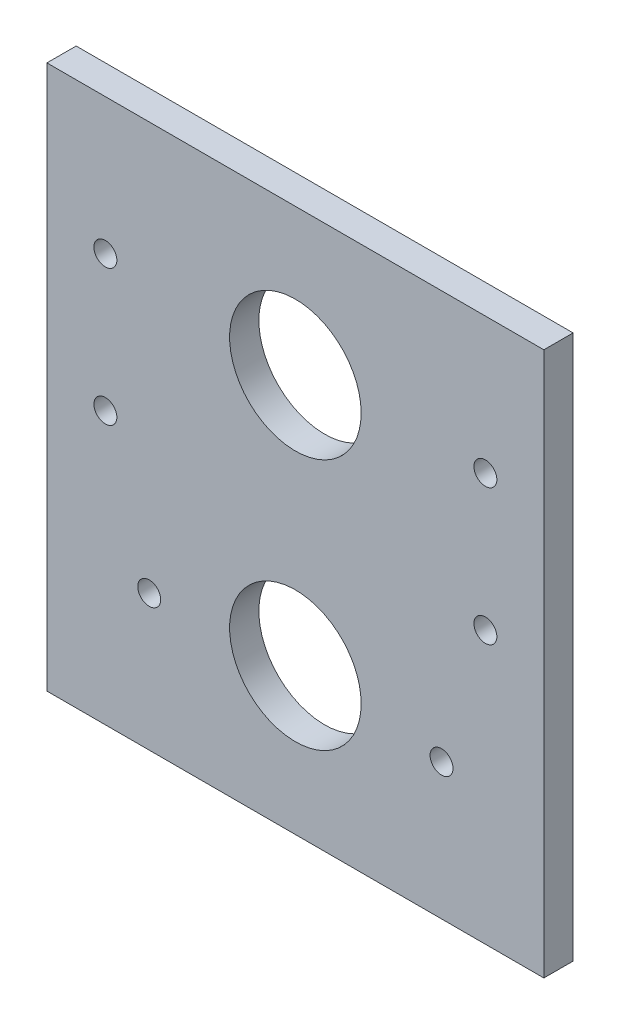
ISO-10303-21;
HEADER;
FILE_DESCRIPTION(('STEP AP214'),'2;1');
FILE_NAME('part.step','',(''),(''),'','','');
FILE_SCHEMA(('AUTOMOTIVE_DESIGN { 1 0 10303 214 1 1 1 1 }'));
ENDSEC;
DATA;
#1=APPLICATION_CONTEXT('core data for automotive mechanical design processes');
#2=APPLICATION_PROTOCOL_DEFINITION('international standard','automotive_design',2000,#1);
#3=PRODUCT_CONTEXT('',#1,'mechanical');
#4=PRODUCT('Part','Part','',(#3));
#5=PRODUCT_RELATED_PRODUCT_CATEGORY('part','',(#4));
#6=PRODUCT_DEFINITION_FORMATION('','',#4);
#7=PRODUCT_DEFINITION_CONTEXT('part definition',#1,'design');
#8=PRODUCT_DEFINITION('design','',#6,#7);
#9=PRODUCT_DEFINITION_SHAPE('','',#8);
#10=(LENGTH_UNIT() NAMED_UNIT(*) SI_UNIT(.MILLI.,.METRE.));
#11=(NAMED_UNIT(*) PLANE_ANGLE_UNIT() SI_UNIT($,.RADIAN.));
#12=(NAMED_UNIT(*) SI_UNIT($,.STERADIAN.) SOLID_ANGLE_UNIT());
#13=UNCERTAINTY_MEASURE_WITH_UNIT(LENGTH_MEASURE(1.E-05),#10,'distance_accuracy_value','');
#14=(GEOMETRIC_REPRESENTATION_CONTEXT(3) GLOBAL_UNCERTAINTY_ASSIGNED_CONTEXT((#13)) GLOBAL_UNIT_ASSIGNED_CONTEXT((#10,
#11,#12)) REPRESENTATION_CONTEXT('',''));
#15=CARTESIAN_POINT('',(0.,0.,0.));
#16=DIRECTION('',(0.,0.,1.));
#17=DIRECTION('',(1.,0.,0.));
#18=AXIS2_PLACEMENT_3D('',#15,#16,#17);
#19=CARTESIAN_POINT('',(0.,0.,6.35));
#20=DIRECTION('',(0.,0.,-1.));
#21=DIRECTION('',(-1.,0.,0.));
#22=AXIS2_PLACEMENT_3D('',#19,#20,#21);
#23=PLANE('',#22);
#24=DIRECTION('',(0.,-1.,0.));
#25=VECTOR('',#24,1.);
#26=CARTESIAN_POINT('',(0.,0.,6.35));
#27=LINE('',#26,#25);
#28=CARTESIAN_POINT('',(0.,118.1862,6.35));
#29=VERTEX_POINT('',#28);
#30=CARTESIAN_POINT('',(0.,0.,6.35));
#31=VERTEX_POINT('',#30);
#32=EDGE_CURVE('E87',#29,#31,#27,.T.);
#33=ORIENTED_EDGE('',*,*,#32,.T.);
#34=DIRECTION('',(1.,0.,0.));
#35=VECTOR('',#34,1.);
#36=CARTESIAN_POINT('',(0.,0.,6.35));
#37=LINE('',#36,#35);
#38=CARTESIAN_POINT('',(107.95,0.,6.35));
#39=VERTEX_POINT('',#38);
#40=EDGE_CURVE('E82',#31,#39,#37,.T.);
#41=ORIENTED_EDGE('',*,*,#40,.T.);
#42=DIRECTION('',(0.,1.,0.));
#43=VECTOR('',#42,1.);
#44=CARTESIAN_POINT('',(107.95,0.,6.35));
#45=LINE('',#44,#43);
#46=CARTESIAN_POINT('',(107.95,118.1862,6.35));
#47=VERTEX_POINT('',#46);
#48=EDGE_CURVE('E85',#39,#47,#45,.T.);
#49=ORIENTED_EDGE('',*,*,#48,.T.);
#50=DIRECTION('',(-1.,0.,0.));
#51=VECTOR('',#50,1.);
#52=CARTESIAN_POINT('',(0.,118.1862,6.35));
#53=LINE('',#52,#51);
#54=EDGE_CURVE('E52',#47,#29,#53,.T.);
#55=ORIENTED_EDGE('',*,*,#54,.T.);
#56=EDGE_LOOP('',(#33,#41,#49,#55));
#57=FACE_BOUND('',#56,.T.);
#58=CARTESIAN_POINT('',(53.975,86.4362,6.35));
#59=DIRECTION('',(0.,0.,1.));
#60=DIRECTION('',(1.,0.,0.));
#61=AXIS2_PLACEMENT_3D('',#58,#59,#60);
#62=CIRCLE('',#61,14.2875);
#63=CARTESIAN_POINT('',(68.2625,86.4362,6.35));
#64=VERTEX_POINT('',#63);
#65=EDGE_CURVE('E102',#64,#64,#62,.T.);
#66=ORIENTED_EDGE('',*,*,#65,.F.);
#67=EDGE_LOOP('',(#66));
#68=FACE_BOUND('',#67,.T.);
#69=CARTESIAN_POINT('',(53.975,31.75,6.35));
#70=DIRECTION('',(0.,0.,1.));
#71=DIRECTION('',(1.,0.,0.));
#72=AXIS2_PLACEMENT_3D('',#69,#70,#71);
#73=CIRCLE('',#72,14.2875);
#74=CARTESIAN_POINT('',(68.2625,31.75,6.35));
#75=VERTEX_POINT('',#74);
#76=EDGE_CURVE('E117',#75,#75,#73,.T.);
#77=ORIENTED_EDGE('',*,*,#76,.F.);
#78=EDGE_LOOP('',(#77));
#79=FACE_BOUND('',#78,.T.);
#80=CARTESIAN_POINT('',(95.25,59.0931,6.35));
#81=DIRECTION('',(0.,0.,1.));
#82=DIRECTION('',(1.,0.,0.));
#83=AXIS2_PLACEMENT_3D('',#80,#81,#82);
#84=CIRCLE('',#83,2.4892);
#85=CARTESIAN_POINT('',(97.7392,59.0931,6.35));
#86=VERTEX_POINT('',#85);
#87=EDGE_CURVE('E123',#86,#86,#84,.T.);
#88=ORIENTED_EDGE('',*,*,#87,.F.);
#89=EDGE_LOOP('',(#88));
#90=FACE_BOUND('',#89,.T.);
#91=CARTESIAN_POINT('',(95.25,88.63965,6.35));
#92=DIRECTION('',(0.,0.,1.));
#93=DIRECTION('',(1.,0.,0.));
#94=AXIS2_PLACEMENT_3D('',#91,#92,#93);
#95=CIRCLE('',#94,2.4892);
#96=CARTESIAN_POINT('',(97.7392,88.63965,6.35));
#97=VERTEX_POINT('',#96);
#98=EDGE_CURVE('E129',#97,#97,#95,.T.);
#99=ORIENTED_EDGE('',*,*,#98,.F.);
#100=EDGE_LOOP('',(#99));
#101=FACE_BOUND('',#100,.T.);
#102=CARTESIAN_POINT('',(12.7,88.63965,6.35));
#103=DIRECTION('',(0.,0.,1.));
#104=DIRECTION('',(1.,0.,0.));
#105=AXIS2_PLACEMENT_3D('',#102,#103,#104);
#106=CIRCLE('',#105,2.48919999999999);
#107=CARTESIAN_POINT('',(15.1892,88.63965,6.35));
#108=VERTEX_POINT('',#107);
#109=EDGE_CURVE('E135',#108,#108,#106,.T.);
#110=ORIENTED_EDGE('',*,*,#109,.F.);
#111=EDGE_LOOP('',(#110));
#112=FACE_BOUND('',#111,.T.);
#113=CARTESIAN_POINT('',(12.7,59.0931,6.35));
#114=DIRECTION('',(0.,0.,1.));
#115=DIRECTION('',(1.,0.,0.));
#116=AXIS2_PLACEMENT_3D('',#113,#114,#115);
#117=CIRCLE('',#116,2.4892);
#118=CARTESIAN_POINT('',(15.1892,59.0931,6.35));
#119=VERTEX_POINT('',#118);
#120=EDGE_CURVE('E141',#119,#119,#117,.T.);
#121=ORIENTED_EDGE('',*,*,#120,.F.);
#122=EDGE_LOOP('',(#121));
#123=FACE_BOUND('',#122,.T.);
#124=CARTESIAN_POINT('',(22.225,29.54655,6.35));
#125=DIRECTION('',(0.,0.,1.));
#126=DIRECTION('',(1.,0.,0.));
#127=AXIS2_PLACEMENT_3D('',#124,#125,#126);
#128=CIRCLE('',#127,2.4892);
#129=CARTESIAN_POINT('',(24.7142,29.54655,6.35));
#130=VERTEX_POINT('',#129);
#131=EDGE_CURVE('E147',#130,#130,#128,.T.);
#132=ORIENTED_EDGE('',*,*,#131,.F.);
#133=EDGE_LOOP('',(#132));
#134=FACE_BOUND('',#133,.T.);
#135=CARTESIAN_POINT('',(85.725,29.54655,6.35));
#136=DIRECTION('',(0.,0.,1.));
#137=DIRECTION('',(1.,0.,0.));
#138=AXIS2_PLACEMENT_3D('',#135,#136,#137);
#139=CIRCLE('',#138,2.4892);
#140=CARTESIAN_POINT('',(88.2142,29.54655,6.35));
#141=VERTEX_POINT('',#140);
#142=EDGE_CURVE('E153',#141,#141,#139,.T.);
#143=ORIENTED_EDGE('',*,*,#142,.F.);
#144=EDGE_LOOP('',(#143));
#145=FACE_BOUND('',#144,.T.);
#146=ADVANCED_FACE('F35',(#57,#68,#79,#90,#101,#112,#123,#134,#145),#23,.F.);
#147=CARTESIAN_POINT('',(0.,0.,0.));
#148=DIRECTION('',(0.,0.,-1.));
#149=DIRECTION('',(-1.,0.,0.));
#150=AXIS2_PLACEMENT_3D('',#147,#148,#149);
#151=PLANE('',#150);
#152=CARTESIAN_POINT('',(22.225,29.54655,0.));
#153=DIRECTION('',(0.,0.,1.));
#154=DIRECTION('',(1.,0.,0.));
#155=AXIS2_PLACEMENT_3D('',#152,#153,#154);
#156=CIRCLE('',#155,2.4892);
#157=CARTESIAN_POINT('',(24.7142,29.54655,0.));
#158=VERTEX_POINT('',#157);
#159=EDGE_CURVE('E150',#158,#158,#156,.T.);
#160=ORIENTED_EDGE('',*,*,#159,.T.);
#161=EDGE_LOOP('',(#160));
#162=FACE_BOUND('',#161,.T.);
#163=CARTESIAN_POINT('',(12.7,88.63965,0.));
#164=DIRECTION('',(0.,0.,1.));
#165=DIRECTION('',(1.,0.,0.));
#166=AXIS2_PLACEMENT_3D('',#163,#164,#165);
#167=CIRCLE('',#166,2.48919999999999);
#168=CARTESIAN_POINT('',(15.1892,88.63965,0.));
#169=VERTEX_POINT('',#168);
#170=EDGE_CURVE('E138',#169,#169,#167,.T.);
#171=ORIENTED_EDGE('',*,*,#170,.T.);
#172=EDGE_LOOP('',(#171));
#173=FACE_BOUND('',#172,.T.);
#174=CARTESIAN_POINT('',(95.25,59.0931,0.));
#175=DIRECTION('',(0.,0.,1.));
#176=DIRECTION('',(1.,0.,0.));
#177=AXIS2_PLACEMENT_3D('',#174,#175,#176);
#178=CIRCLE('',#177,2.4892);
#179=CARTESIAN_POINT('',(97.7392,59.0931,0.));
#180=VERTEX_POINT('',#179);
#181=EDGE_CURVE('E126',#180,#180,#178,.T.);
#182=ORIENTED_EDGE('',*,*,#181,.T.);
#183=EDGE_LOOP('',(#182));
#184=FACE_BOUND('',#183,.T.);
#185=CARTESIAN_POINT('',(53.975,86.4362,0.));
#186=DIRECTION('',(0.,0.,1.));
#187=DIRECTION('',(1.,0.,0.));
#188=AXIS2_PLACEMENT_3D('',#185,#186,#187);
#189=CIRCLE('',#188,14.2875);
#190=CARTESIAN_POINT('',(68.2625,86.4362,0.));
#191=VERTEX_POINT('',#190);
#192=EDGE_CURVE('E114',#191,#191,#189,.T.);
#193=ORIENTED_EDGE('',*,*,#192,.T.);
#194=EDGE_LOOP('',(#193));
#195=FACE_BOUND('',#194,.T.);
#196=DIRECTION('',(0.,-1.,0.));
#197=VECTOR('',#196,1.);
#198=CARTESIAN_POINT('',(0.,0.,0.));
#199=LINE('',#198,#197);
#200=CARTESIAN_POINT('',(0.,118.1862,0.));
#201=VERTEX_POINT('',#200);
#202=CARTESIAN_POINT('',(0.,0.,0.));
#203=VERTEX_POINT('',#202);
#204=EDGE_CURVE('E99',#201,#203,#199,.T.);
#205=ORIENTED_EDGE('',*,*,#204,.F.);
#206=DIRECTION('',(-1.,0.,0.));
#207=VECTOR('',#206,1.);
#208=CARTESIAN_POINT('',(0.,118.1862,0.));
#209=LINE('',#208,#207);
#210=CARTESIAN_POINT('',(107.95,118.1862,0.));
#211=VERTEX_POINT('',#210);
#212=EDGE_CURVE('E75',#211,#201,#209,.T.);
#213=ORIENTED_EDGE('',*,*,#212,.F.);
#214=DIRECTION('',(0.,1.,0.));
#215=VECTOR('',#214,1.);
#216=CARTESIAN_POINT('',(107.95,0.,0.));
#217=LINE('',#216,#215);
#218=CARTESIAN_POINT('',(107.95,0.,0.));
#219=VERTEX_POINT('',#218);
#220=EDGE_CURVE('E69',#219,#211,#217,.T.);
#221=ORIENTED_EDGE('',*,*,#220,.F.);
#222=DIRECTION('',(1.,0.,0.));
#223=VECTOR('',#222,1.);
#224=CARTESIAN_POINT('',(0.,0.,0.));
#225=LINE('',#224,#223);
#226=EDGE_CURVE('E91',#203,#219,#225,.T.);
#227=ORIENTED_EDGE('',*,*,#226,.F.);
#228=EDGE_LOOP('',(#205,#213,#221,#227));
#229=FACE_BOUND('',#228,.T.);
#230=CARTESIAN_POINT('',(53.975,31.75,0.));
#231=DIRECTION('',(0.,0.,1.));
#232=DIRECTION('',(1.,0.,0.));
#233=AXIS2_PLACEMENT_3D('',#230,#231,#232);
#234=CIRCLE('',#233,14.2875);
#235=CARTESIAN_POINT('',(68.2625,31.75,0.));
#236=VERTEX_POINT('',#235);
#237=EDGE_CURVE('E120',#236,#236,#234,.T.);
#238=ORIENTED_EDGE('',*,*,#237,.T.);
#239=EDGE_LOOP('',(#238));
#240=FACE_BOUND('',#239,.T.);
#241=CARTESIAN_POINT('',(95.25,88.63965,0.));
#242=DIRECTION('',(0.,0.,1.));
#243=DIRECTION('',(1.,0.,0.));
#244=AXIS2_PLACEMENT_3D('',#241,#242,#243);
#245=CIRCLE('',#244,2.4892);
#246=CARTESIAN_POINT('',(97.7392,88.63965,0.));
#247=VERTEX_POINT('',#246);
#248=EDGE_CURVE('E132',#247,#247,#245,.T.);
#249=ORIENTED_EDGE('',*,*,#248,.T.);
#250=EDGE_LOOP('',(#249));
#251=FACE_BOUND('',#250,.T.);
#252=CARTESIAN_POINT('',(12.7,59.0931,0.));
#253=DIRECTION('',(0.,0.,1.));
#254=DIRECTION('',(1.,0.,0.));
#255=AXIS2_PLACEMENT_3D('',#252,#253,#254);
#256=CIRCLE('',#255,2.4892);
#257=CARTESIAN_POINT('',(15.1892,59.0931,0.));
#258=VERTEX_POINT('',#257);
#259=EDGE_CURVE('E144',#258,#258,#256,.T.);
#260=ORIENTED_EDGE('',*,*,#259,.T.);
#261=EDGE_LOOP('',(#260));
#262=FACE_BOUND('',#261,.T.);
#263=CARTESIAN_POINT('',(85.725,29.54655,0.));
#264=DIRECTION('',(0.,0.,1.));
#265=DIRECTION('',(1.,0.,0.));
#266=AXIS2_PLACEMENT_3D('',#263,#264,#265);
#267=CIRCLE('',#266,2.4892);
#268=CARTESIAN_POINT('',(88.2142,29.54655,0.));
#269=VERTEX_POINT('',#268);
#270=EDGE_CURVE('E156',#269,#269,#267,.T.);
#271=ORIENTED_EDGE('',*,*,#270,.T.);
#272=EDGE_LOOP('',(#271));
#273=FACE_BOUND('',#272,.T.);
#274=ADVANCED_FACE('F110',(#162,#173,#184,#195,#229,#240,#251,#262,#273),#151,.T.);
#275=CARTESIAN_POINT('',(0.,0.,6.35));
#276=DIRECTION('',(1.,0.,0.));
#277=DIRECTION('',(0.,0.,-1.));
#278=AXIS2_PLACEMENT_3D('',#275,#276,#277);
#279=PLANE('',#278);
#280=ORIENTED_EDGE('',*,*,#204,.T.);
#281=DIRECTION('',(0.,0.,-1.));
#282=VECTOR('',#281,1.);
#283=CARTESIAN_POINT('',(0.,0.,6.35));
#284=LINE('',#283,#282);
#285=EDGE_CURVE('E11',#31,#203,#284,.T.);
#286=ORIENTED_EDGE('',*,*,#285,.F.);
#287=ORIENTED_EDGE('',*,*,#32,.F.);
#288=DIRECTION('',(0.,0.,-1.));
#289=VECTOR('',#288,1.);
#290=CARTESIAN_POINT('',(0.,118.1862,6.35));
#291=LINE('',#290,#289);
#292=EDGE_CURVE('E95',#29,#201,#291,.T.);
#293=ORIENTED_EDGE('',*,*,#292,.T.);
#294=EDGE_LOOP('',(#280,#286,#287,#293));
#295=FACE_BOUND('',#294,.T.);
#296=ADVANCED_FACE('F37',(#295),#279,.F.);
#297=CARTESIAN_POINT('',(0.,0.,6.35));
#298=DIRECTION('',(0.,1.,0.));
#299=DIRECTION('',(-1.,0.,0.));
#300=AXIS2_PLACEMENT_3D('',#297,#298,#299);
#301=PLANE('',#300);
#302=ORIENTED_EDGE('',*,*,#226,.T.);
#303=DIRECTION('',(0.,0.,-1.));
#304=VECTOR('',#303,1.);
#305=CARTESIAN_POINT('',(107.95,0.,6.35));
#306=LINE('',#305,#304);
#307=EDGE_CURVE('E44',#39,#219,#306,.T.);
#308=ORIENTED_EDGE('',*,*,#307,.F.);
#309=ORIENTED_EDGE('',*,*,#40,.F.);
#310=ORIENTED_EDGE('',*,*,#285,.T.);
#311=EDGE_LOOP('',(#302,#308,#309,#310));
#312=FACE_BOUND('',#311,.T.);
#313=ADVANCED_FACE('F90',(#312),#301,.F.);
#314=CARTESIAN_POINT('',(107.95,0.,6.35));
#315=DIRECTION('',(-1.,0.,0.));
#316=DIRECTION('',(0.,0.,1.));
#317=AXIS2_PLACEMENT_3D('',#314,#315,#316);
#318=PLANE('',#317);
#319=ORIENTED_EDGE('',*,*,#220,.T.);
#320=DIRECTION('',(0.,0.,-1.));
#321=VECTOR('',#320,1.);
#322=CARTESIAN_POINT('',(107.95,118.1862,6.35));
#323=LINE('',#322,#321);
#324=EDGE_CURVE('E92',#47,#211,#323,.T.);
#325=ORIENTED_EDGE('',*,*,#324,.F.);
#326=ORIENTED_EDGE('',*,*,#48,.F.);
#327=ORIENTED_EDGE('',*,*,#307,.T.);
#328=EDGE_LOOP('',(#319,#325,#326,#327));
#329=FACE_BOUND('',#328,.T.);
#330=ADVANCED_FACE('F93',(#329),#318,.F.);
#331=CARTESIAN_POINT('',(0.,118.1862,6.35));
#332=DIRECTION('',(0.,-1.,0.));
#333=DIRECTION('',(1.,0.,0.));
#334=AXIS2_PLACEMENT_3D('',#331,#332,#333);
#335=PLANE('',#334);
#336=ORIENTED_EDGE('',*,*,#212,.T.);
#337=ORIENTED_EDGE('',*,*,#292,.F.);
#338=ORIENTED_EDGE('',*,*,#54,.F.);
#339=ORIENTED_EDGE('',*,*,#324,.T.);
#340=EDGE_LOOP('',(#336,#337,#338,#339));
#341=FACE_BOUND('',#340,.T.);
#342=ADVANCED_FACE('F107',(#341),#335,.F.);
#343=CARTESIAN_POINT('',(53.975,86.4362,6.35));
#344=DIRECTION('',(0.,0.,-1.));
#345=DIRECTION('',(-1.,0.,0.));
#346=AXIS2_PLACEMENT_3D('',#343,#344,#345);
#347=CYLINDRICAL_SURFACE('',#346,14.2875);
#348=ORIENTED_EDGE('',*,*,#65,.T.);
#349=EDGE_LOOP('',(#348));
#350=FACE_BOUND('',#349,.T.);
#351=ORIENTED_EDGE('',*,*,#192,.F.);
#352=EDGE_LOOP('',(#351));
#353=FACE_BOUND('',#352,.T.);
#354=ADVANCED_FACE('F173',(#350,#353),#347,.F.);
#355=CARTESIAN_POINT('',(53.975,31.75,6.35));
#356=DIRECTION('',(0.,0.,-1.));
#357=DIRECTION('',(-1.,0.,0.));
#358=AXIS2_PLACEMENT_3D('',#355,#356,#357);
#359=CYLINDRICAL_SURFACE('',#358,14.2875);
#360=ORIENTED_EDGE('',*,*,#76,.T.);
#361=EDGE_LOOP('',(#360));
#362=FACE_BOUND('',#361,.T.);
#363=ORIENTED_EDGE('',*,*,#237,.F.);
#364=EDGE_LOOP('',(#363));
#365=FACE_BOUND('',#364,.T.);
#366=ADVANCED_FACE('F219',(#362,#365),#359,.F.);
#367=CARTESIAN_POINT('',(95.25,59.0931,6.35));
#368=DIRECTION('',(0.,0.,-1.));
#369=DIRECTION('',(-1.,0.,0.));
#370=AXIS2_PLACEMENT_3D('',#367,#368,#369);
#371=CYLINDRICAL_SURFACE('',#370,2.4892);
#372=ORIENTED_EDGE('',*,*,#87,.T.);
#373=EDGE_LOOP('',(#372));
#374=FACE_BOUND('',#373,.T.);
#375=ORIENTED_EDGE('',*,*,#181,.F.);
#376=EDGE_LOOP('',(#375));
#377=FACE_BOUND('',#376,.T.);
#378=ADVANCED_FACE('F227',(#374,#377),#371,.F.);
#379=CARTESIAN_POINT('',(95.25,88.63965,6.35));
#380=DIRECTION('',(0.,0.,-1.));
#381=DIRECTION('',(-1.,0.,0.));
#382=AXIS2_PLACEMENT_3D('',#379,#380,#381);
#383=CYLINDRICAL_SURFACE('',#382,2.4892);
#384=ORIENTED_EDGE('',*,*,#98,.T.);
#385=EDGE_LOOP('',(#384));
#386=FACE_BOUND('',#385,.T.);
#387=ORIENTED_EDGE('',*,*,#248,.F.);
#388=EDGE_LOOP('',(#387));
#389=FACE_BOUND('',#388,.T.);
#390=ADVANCED_FACE('F235',(#386,#389),#383,.F.);
#391=CARTESIAN_POINT('',(12.7,88.63965,6.35));
#392=DIRECTION('',(0.,0.,-1.));
#393=DIRECTION('',(-1.,0.,0.));
#394=AXIS2_PLACEMENT_3D('',#391,#392,#393);
#395=CYLINDRICAL_SURFACE('',#394,2.48919999999999);
#396=ORIENTED_EDGE('',*,*,#109,.T.);
#397=EDGE_LOOP('',(#396));
#398=FACE_BOUND('',#397,.T.);
#399=ORIENTED_EDGE('',*,*,#170,.F.);
#400=EDGE_LOOP('',(#399));
#401=FACE_BOUND('',#400,.T.);
#402=ADVANCED_FACE('F244',(#398,#401),#395,.F.);
#403=CARTESIAN_POINT('',(12.7,59.0931,6.35));
#404=DIRECTION('',(0.,0.,-1.));
#405=DIRECTION('',(-1.,0.,0.));
#406=AXIS2_PLACEMENT_3D('',#403,#404,#405);
#407=CYLINDRICAL_SURFACE('',#406,2.4892);
#408=ORIENTED_EDGE('',*,*,#120,.T.);
#409=EDGE_LOOP('',(#408));
#410=FACE_BOUND('',#409,.T.);
#411=ORIENTED_EDGE('',*,*,#259,.F.);
#412=EDGE_LOOP('',(#411));
#413=FACE_BOUND('',#412,.T.);
#414=ADVANCED_FACE('F253',(#410,#413),#407,.F.);
#415=CARTESIAN_POINT('',(22.225,29.54655,6.35));
#416=DIRECTION('',(0.,0.,-1.));
#417=DIRECTION('',(-1.,0.,0.));
#418=AXIS2_PLACEMENT_3D('',#415,#416,#417);
#419=CYLINDRICAL_SURFACE('',#418,2.4892);
#420=ORIENTED_EDGE('',*,*,#131,.T.);
#421=EDGE_LOOP('',(#420));
#422=FACE_BOUND('',#421,.T.);
#423=ORIENTED_EDGE('',*,*,#159,.F.);
#424=EDGE_LOOP('',(#423));
#425=FACE_BOUND('',#424,.T.);
#426=ADVANCED_FACE('F262',(#422,#425),#419,.F.);
#427=CARTESIAN_POINT('',(85.725,29.54655,6.35));
#428=DIRECTION('',(0.,0.,-1.));
#429=DIRECTION('',(-1.,0.,0.));
#430=AXIS2_PLACEMENT_3D('',#427,#428,#429);
#431=CYLINDRICAL_SURFACE('',#430,2.4892);
#432=ORIENTED_EDGE('',*,*,#142,.T.);
#433=EDGE_LOOP('',(#432));
#434=FACE_BOUND('',#433,.T.);
#435=ORIENTED_EDGE('',*,*,#270,.F.);
#436=EDGE_LOOP('',(#435));
#437=FACE_BOUND('',#436,.T.);
#438=ADVANCED_FACE('F162',(#434,#437),#431,.F.);
#439=CLOSED_SHELL('',(#146,#274,#296,#313,#330,#342,#354,#366,#378,#390,#402,#414,#426,#438));
#440=MANIFOLD_SOLID_BREP('B2',#439);
#441=ADVANCED_BREP_SHAPE_REPRESENTATION('',(#18,#440),#14);
#442=SHAPE_DEFINITION_REPRESENTATION(#9,#441);
ENDSEC;
END-ISO-10303-21;
